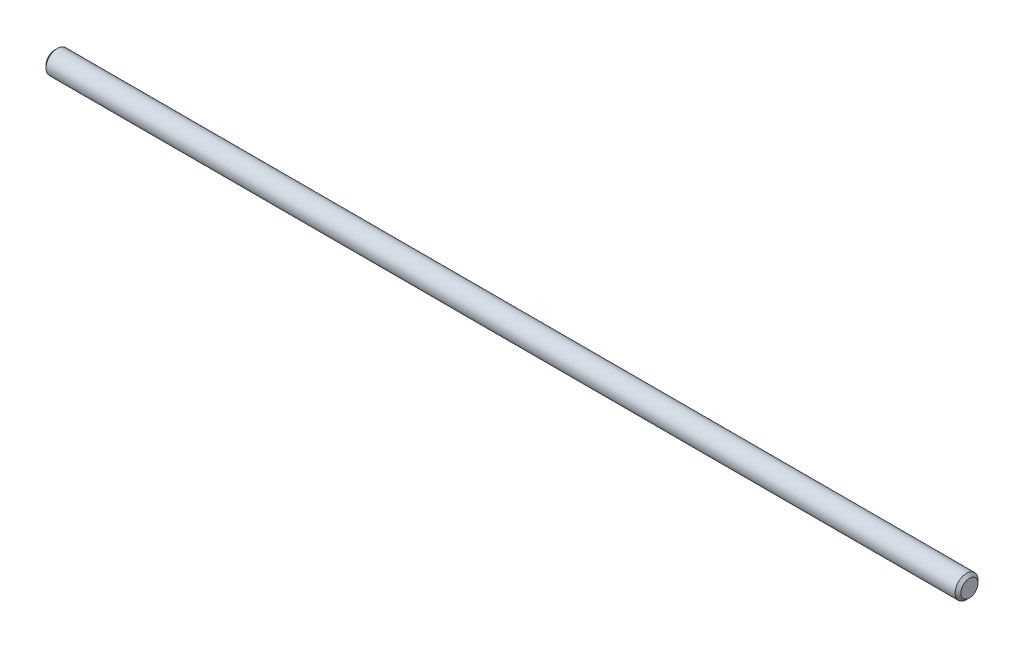
ISO-10303-21;
HEADER;
FILE_DESCRIPTION(('STEP AP214'),'2;1');
FILE_NAME('part.step','',(''),(''),'','','');
FILE_SCHEMA(('AUTOMOTIVE_DESIGN { 1 0 10303 214 1 1 1 1 }'));
ENDSEC;
DATA;
#1=APPLICATION_CONTEXT('core data for automotive mechanical design processes');
#2=APPLICATION_PROTOCOL_DEFINITION('international standard','automotive_design',2000,#1);
#3=PRODUCT_CONTEXT('',#1,'mechanical');
#4=PRODUCT('Part','Part','',(#3));
#5=PRODUCT_RELATED_PRODUCT_CATEGORY('part','',(#4));
#6=PRODUCT_DEFINITION_FORMATION('','',#4);
#7=PRODUCT_DEFINITION_CONTEXT('part definition',#1,'design');
#8=PRODUCT_DEFINITION('design','',#6,#7);
#9=PRODUCT_DEFINITION_SHAPE('','',#8);
#10=(LENGTH_UNIT() NAMED_UNIT(*) SI_UNIT(.MILLI.,.METRE.));
#11=(NAMED_UNIT(*) PLANE_ANGLE_UNIT() SI_UNIT($,.RADIAN.));
#12=(NAMED_UNIT(*) SI_UNIT($,.STERADIAN.) SOLID_ANGLE_UNIT());
#13=UNCERTAINTY_MEASURE_WITH_UNIT(LENGTH_MEASURE(1.E-05),#10,'distance_accuracy_value','');
#14=(GEOMETRIC_REPRESENTATION_CONTEXT(3) GLOBAL_UNCERTAINTY_ASSIGNED_CONTEXT((#13)) GLOBAL_UNIT_ASSIGNED_CONTEXT((#10,
#11,#12)) REPRESENTATION_CONTEXT('',''));
#15=CARTESIAN_POINT('',(0.,0.,0.));
#16=DIRECTION('',(0.,0.,1.));
#17=DIRECTION('',(1.,0.,0.));
#18=AXIS2_PLACEMENT_3D('',#15,#16,#17);
#19=CARTESIAN_POINT('',(160.,0.,0.));
#20=DIRECTION('',(-1.,0.,0.));
#21=DIRECTION('',(0.,0.,1.));
#22=AXIS2_PLACEMENT_3D('',#19,#20,#21);
#23=CYLINDRICAL_SURFACE('',#22,2.);
#24=CARTESIAN_POINT('',(0.499999999999973,0.,0.));
#25=DIRECTION('',(1.,0.,0.));
#26=DIRECTION('',(0.,0.,-1.));
#27=AXIS2_PLACEMENT_3D('',#24,#25,#26);
#28=CIRCLE('',#27,2.);
#29=CARTESIAN_POINT('',(0.499999999999973,0.,-2.));
#30=VERTEX_POINT('',#29);
#31=EDGE_CURVE('E57',#30,#30,#28,.T.);
#32=ORIENTED_EDGE('',*,*,#31,.T.);
#33=EDGE_LOOP('',(#32));
#34=FACE_BOUND('',#33,.T.);
#35=CARTESIAN_POINT('',(159.5,0.,0.));
#36=DIRECTION('',(1.,0.,0.));
#37=DIRECTION('',(0.,0.,-1.));
#38=AXIS2_PLACEMENT_3D('',#35,#36,#37);
#39=CIRCLE('',#38,2.);
#40=CARTESIAN_POINT('',(159.5,0.,-2.));
#41=VERTEX_POINT('',#40);
#42=EDGE_CURVE('E62',#41,#41,#39,.F.);
#43=ORIENTED_EDGE('',*,*,#42,.T.);
#44=EDGE_LOOP('',(#43));
#45=FACE_BOUND('',#44,.T.);
#46=ADVANCED_FACE('F43',(#34,#45),#23,.T.);
#47=CARTESIAN_POINT('',(160.,0.,0.));
#48=DIRECTION('',(1.,0.,0.));
#49=DIRECTION('',(0.,0.,-1.));
#50=AXIS2_PLACEMENT_3D('',#47,#48,#49);
#51=PLANE('',#50);
#52=CARTESIAN_POINT('',(160.,0.,0.));
#53=DIRECTION('',(1.,0.,0.));
#54=DIRECTION('',(0.,0.,-1.));
#55=AXIS2_PLACEMENT_3D('',#52,#53,#54);
#56=CIRCLE('',#55,1.5);
#57=CARTESIAN_POINT('',(160.,0.,-1.5));
#58=VERTEX_POINT('',#57);
#59=EDGE_CURVE('E10',#58,#58,#56,.T.);
#60=ORIENTED_EDGE('',*,*,#59,.T.);
#61=EDGE_LOOP('',(#60));
#62=FACE_BOUND('',#61,.T.);
#63=ADVANCED_FACE('F79',(#62),#51,.T.);
#64=CARTESIAN_POINT('',(0.,0.,0.));
#65=DIRECTION('',(1.,0.,0.));
#66=DIRECTION('',(0.,0.,-1.));
#67=AXIS2_PLACEMENT_3D('',#64,#65,#66);
#68=PLANE('',#67);
#69=CARTESIAN_POINT('',(0.,0.,0.));
#70=DIRECTION('',(1.,0.,0.));
#71=DIRECTION('',(0.,0.,-1.));
#72=AXIS2_PLACEMENT_3D('',#69,#70,#71);
#73=CIRCLE('',#72,1.50000000000002);
#74=CARTESIAN_POINT('',(0.,0.,-1.50000000000002));
#75=VERTEX_POINT('',#74);
#76=EDGE_CURVE('E52',#75,#75,#73,.F.);
#77=ORIENTED_EDGE('',*,*,#76,.T.);
#78=EDGE_LOOP('',(#77));
#79=FACE_BOUND('',#78,.T.);
#80=ADVANCED_FACE('F76',(#79),#68,.F.);
#81=CARTESIAN_POINT('',(0.499999999999973,0.,0.));
#82=DIRECTION('',(1.,0.,0.));
#83=DIRECTION('',(0.,0.,-1.));
#84=AXIS2_PLACEMENT_3D('',#81,#82,#83);
#85=CONICAL_SURFACE('',#84,2.,0.78539816339746);
#86=ORIENTED_EDGE('',*,*,#76,.F.);
#87=EDGE_LOOP('',(#86));
#88=FACE_BOUND('',#87,.T.);
#89=ORIENTED_EDGE('',*,*,#31,.F.);
#90=EDGE_LOOP('',(#89));
#91=FACE_BOUND('',#90,.T.);
#92=ADVANCED_FACE('F72',(#88,#91),#85,.T.);
#93=CARTESIAN_POINT('',(160.,0.,0.));
#94=DIRECTION('',(-1.,0.,0.));
#95=DIRECTION('',(0.,0.,1.));
#96=AXIS2_PLACEMENT_3D('',#93,#94,#95);
#97=CONICAL_SURFACE('',#96,1.5,0.785398163397419);
#98=ORIENTED_EDGE('',*,*,#42,.F.);
#99=EDGE_LOOP('',(#98));
#100=FACE_BOUND('',#99,.T.);
#101=ORIENTED_EDGE('',*,*,#59,.F.);
#102=EDGE_LOOP('',(#101));
#103=FACE_BOUND('',#102,.T.);
#104=ADVANCED_FACE('F46',(#100,#103),#97,.T.);
#105=CLOSED_SHELL('',(#46,#63,#80,#92,#104));
#106=MANIFOLD_SOLID_BREP('B2',#105);
#107=ADVANCED_BREP_SHAPE_REPRESENTATION('',(#18,#106),#14);
#108=SHAPE_DEFINITION_REPRESENTATION(#9,#107);
ENDSEC;
END-ISO-10303-21;
